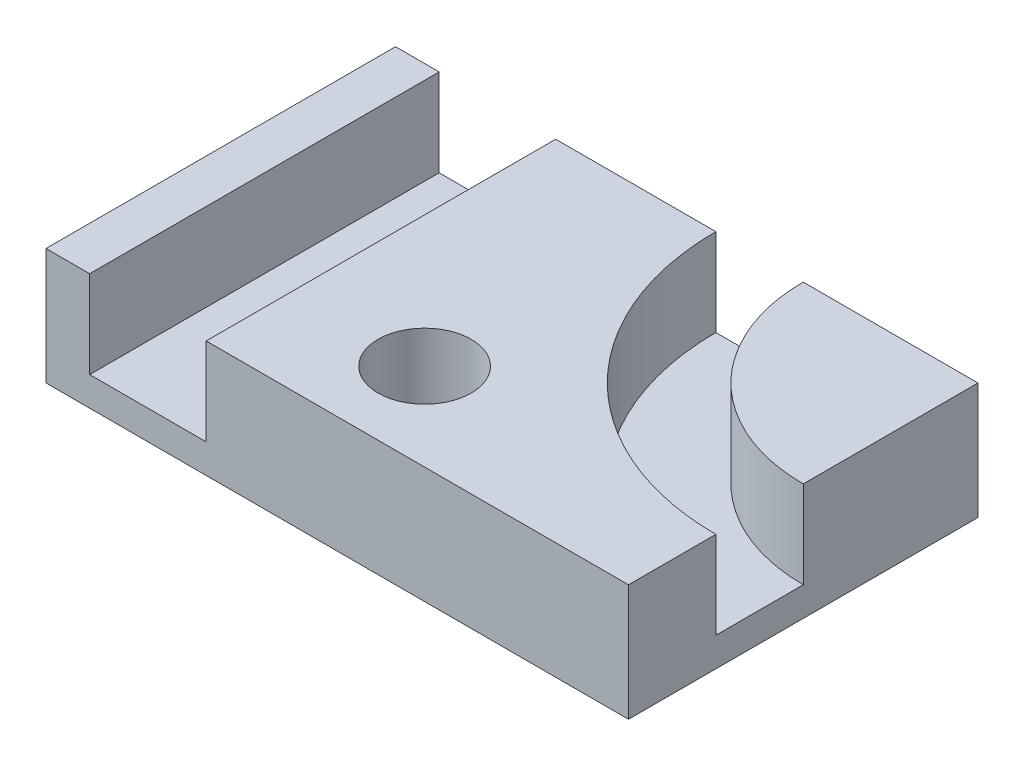
ISO-10303-21;
HEADER;
FILE_DESCRIPTION(('STEP AP214'),'2;1');
FILE_NAME('part.step','',(''),(''),'','','');
FILE_SCHEMA(('AUTOMOTIVE_DESIGN { 1 0 10303 214 1 1 1 1 }'));
ENDSEC;
DATA;
#1=APPLICATION_CONTEXT('core data for automotive mechanical design processes');
#2=APPLICATION_PROTOCOL_DEFINITION('international standard','automotive_design',2000,#1);
#3=PRODUCT_CONTEXT('',#1,'mechanical');
#4=PRODUCT('Part','Part','',(#3));
#5=PRODUCT_RELATED_PRODUCT_CATEGORY('part','',(#4));
#6=PRODUCT_DEFINITION_FORMATION('','',#4);
#7=PRODUCT_DEFINITION_CONTEXT('part definition',#1,'design');
#8=PRODUCT_DEFINITION('design','',#6,#7);
#9=PRODUCT_DEFINITION_SHAPE('','',#8);
#10=(LENGTH_UNIT() NAMED_UNIT(*) SI_UNIT(.MILLI.,.METRE.));
#11=(NAMED_UNIT(*) PLANE_ANGLE_UNIT() SI_UNIT($,.RADIAN.));
#12=(NAMED_UNIT(*) SI_UNIT($,.STERADIAN.) SOLID_ANGLE_UNIT());
#13=UNCERTAINTY_MEASURE_WITH_UNIT(LENGTH_MEASURE(1.E-05),#10,'distance_accuracy_value','');
#14=(GEOMETRIC_REPRESENTATION_CONTEXT(3) GLOBAL_UNCERTAINTY_ASSIGNED_CONTEXT((#13)) GLOBAL_UNIT_ASSIGNED_CONTEXT((#10,
#11,#12)) REPRESENTATION_CONTEXT('',''));
#15=CARTESIAN_POINT('',(0.,0.,0.));
#16=DIRECTION('',(0.,0.,1.));
#17=DIRECTION('',(1.,0.,0.));
#18=AXIS2_PLACEMENT_3D('',#15,#16,#17);
#19=CARTESIAN_POINT('',(0.,20.,0.));
#20=DIRECTION('',(0.,-1.,0.));
#21=DIRECTION('',(0.,0.,-1.));
#22=AXIS2_PLACEMENT_3D('',#19,#20,#21);
#23=PLANE('',#22);
#24=CARTESIAN_POINT('',(0.,20.,15.));
#25=DIRECTION('',(0.,1.,0.));
#26=DIRECTION('',(0.,0.,1.));
#27=AXIS2_PLACEMENT_3D('',#24,#25,#26);
#28=CIRCLE('',#27,8.);
#29=CARTESIAN_POINT('',(0.,20.,23.));
#30=VERTEX_POINT('',#29);
#31=EDGE_CURVE('E389',#30,#30,#28,.T.);
#32=ORIENTED_EDGE('',*,*,#31,.F.);
#33=EDGE_LOOP('',(#32));
#34=FACE_BOUND('',#33,.T.);
#35=DIRECTION('',(-1.,0.,0.));
#36=VECTOR('',#35,1.);
#37=CARTESIAN_POINT('',(50.,20.,-30.));
#38=LINE('',#37,#36);
#39=CARTESIAN_POINT('',(5.00230533997547,20.0000000000066,-29.9999999823923));
#40=VERTEX_POINT('',#39);
#41=CARTESIAN_POINT('',(-22.4988473300123,20.,-29.9999999911961));
#42=VERTEX_POINT('',#41);
#43=EDGE_CURVE('E228',#40,#42,#38,.T.);
#44=ORIENTED_EDGE('',*,*,#43,.T.);
#45=DIRECTION('',(0.,0.,-1.));
#46=VECTOR('',#45,1.);
#47=CARTESIAN_POINT('',(-22.4988473300123,20.,-29.9999999911961));
#48=LINE('',#47,#46);
#49=CARTESIAN_POINT('',(-22.4988473300123,20.,30.));
#50=VERTEX_POINT('',#49);
#51=EDGE_CURVE('E131',#50,#42,#48,.T.);
#52=ORIENTED_EDGE('',*,*,#51,.F.);
#53=DIRECTION('',(1.,0.,0.));
#54=VECTOR('',#53,1.);
#55=CARTESIAN_POINT('',(50.,20.,30.));
#56=LINE('',#55,#54);
#57=CARTESIAN_POINT('',(50.,20.,30.));
#58=VERTEX_POINT('',#57);
#59=EDGE_CURVE('E182',#50,#58,#56,.T.);
#60=ORIENTED_EDGE('',*,*,#59,.T.);
#61=DIRECTION('',(0.,0.,-1.));
#62=VECTOR('',#61,1.);
#63=CARTESIAN_POINT('',(50.,20.,-30.));
#64=LINE('',#63,#62);
#65=CARTESIAN_POINT('',(50.,20.,14.9992414456202));
#66=VERTEX_POINT('',#65);
#67=EDGE_CURVE('E195',#58,#66,#64,.T.);
#68=ORIENTED_EDGE('',*,*,#67,.T.);
#69=CARTESIAN_POINT('',(51.4153309673462,20.,14.9796220876293));
#70=CARTESIAN_POINT('',(50.9547824905195,20.,14.9922686550845));
#71=CARTESIAN_POINT('',(50.4676108378161,20.,14.999999696343));
#72=CARTESIAN_POINT('',(47.0951666430904,20.,15.0000018863399));
#73=CARTESIAN_POINT('',(44.1755163550307,20.0000000000045,14.716144606431));
#74=CARTESIAN_POINT('',(38.3020075855144,19.9999999999958,13.5503572406229));
#75=CARTESIAN_POINT('',(35.3702497173021,20.000000000005,12.6690178798986));
#76=CARTESIAN_POINT('',(26.7731310008656,19.9999999999915,9.04114662188423));
#77=CARTESIAN_POINT('',(21.512219414981,20.0000000000018,5.39916392569056));
#78=CARTESIAN_POINT('',(12.8894658556455,20.0000000000018,-3.78048895887511));
#79=CARTESIAN_POINT('',(9.67389335171333,20.0000000000036,-9.15819830833402));
#80=CARTESIAN_POINT('',(6.64605053677977,20.0000000000036,-17.5770754895131));
#81=CARTESIAN_POINT('',(5.94509295226682,20.0000000000004,-20.3939198419866));
#82=CARTESIAN_POINT('',(5.0855304475035,20.0000000000086,-26.0248420934446));
#83=CARTESIAN_POINT('',(4.94845461313945,20.0000000000054,-28.7961091643683));
#84=CARTESIAN_POINT('',(5.02037791237072,20.0000000000054,-31.415330967346));
#85=B_SPLINE_CURVE_WITH_KNOTS('',3,(#69,#70,#71,#72,#73,#74,#75,#76,#77,#78,#79,#80,#81,#82,#83,
#84),.UNSPECIFIED.,.F.,.F.,(4,2,2,2,2,2,2,4),(0.,0.0197251902584563,0.142259541476149,
0.264793892693842,0.509862595129228,0.754931297564614,0.877465648782307,1.),.UNSPECIFIED.);
#86=EDGE_CURVE('E158',#66,#40,#85,.T.);
#87=ORIENTED_EDGE('',*,*,#86,.T.);
#88=EDGE_LOOP('',(#44,#52,#60,#68,#87));
#89=FACE_BOUND('',#88,.T.);
#90=ADVANCED_FACE('F33',(#34,#89),#23,.F.);
#91=CARTESIAN_POINT('',(50.,20.,-30.));
#92=DIRECTION('',(-1.,0.,0.));
#93=DIRECTION('',(0.,0.,1.));
#94=AXIS2_PLACEMENT_3D('',#91,#92,#93);
#95=PLANE('',#94);
#96=DIRECTION('',(0.,-1.,0.));
#97=VECTOR('',#96,1.);
#98=CARTESIAN_POINT('',(50.,12.5,15.));
#99=LINE('',#98,#97);
#100=CARTESIAN_POINT('',(50.0000004554452,4.99999999999659,14.9988067658875));
#101=VERTEX_POINT('',#100);
#102=EDGE_CURVE('E367',#101,#66,#99,.F.);
#103=ORIENTED_EDGE('',*,*,#102,.T.);
#104=ORIENTED_EDGE('',*,*,#67,.F.);
#105=DIRECTION('',(0.,-1.,0.));
#106=VECTOR('',#105,1.);
#107=CARTESIAN_POINT('',(50.,20.,30.));
#108=LINE('',#107,#106);
#109=CARTESIAN_POINT('',(50.,0.,30.));
#110=VERTEX_POINT('',#109);
#111=EDGE_CURVE('E43',#58,#110,#108,.T.);
#112=ORIENTED_EDGE('',*,*,#111,.T.);
#113=DIRECTION('',(0.,0.,-1.));
#114=VECTOR('',#113,1.);
#115=CARTESIAN_POINT('',(50.,0.,-30.));
#116=LINE('',#115,#114);
#117=CARTESIAN_POINT('',(50.,0.,-30.));
#118=VERTEX_POINT('',#117);
#119=EDGE_CURVE('E208',#110,#118,#116,.T.);
#120=ORIENTED_EDGE('',*,*,#119,.T.);
#121=DIRECTION('',(0.,-1.,0.));
#122=VECTOR('',#121,1.);
#123=CARTESIAN_POINT('',(50.,20.,-30.));
#124=LINE('',#123,#122);
#125=CARTESIAN_POINT('',(50.,20.,-30.));
#126=VERTEX_POINT('',#125);
#127=EDGE_CURVE('E200',#126,#118,#124,.T.);
#128=ORIENTED_EDGE('',*,*,#127,.F.);
#129=CARTESIAN_POINT('',(50.,20.,-0.00129815400017053));
#130=VERTEX_POINT('',#129);
#131=EDGE_CURVE('E187',#130,#126,#64,.T.);
#132=ORIENTED_EDGE('',*,*,#131,.F.);
#133=DIRECTION('',(0.,1.,0.));
#134=VECTOR('',#133,1.);
#135=CARTESIAN_POINT('',(50.,12.5,0.));
#136=LINE('',#135,#134);
#137=CARTESIAN_POINT('',(50.0000044277978,5.,-0.00064989275972179));
#138=VERTEX_POINT('',#137);
#139=EDGE_CURVE('E59',#130,#138,#136,.F.);
#140=ORIENTED_EDGE('',*,*,#139,.T.);
#141=DIRECTION('',(0.,-3.03599773165915E-13,1.));
#142=VECTOR('',#141,1.);
#143=CARTESIAN_POINT('',(50.,5.00000000000001,-0.014725805378779));
#144=LINE('',#143,#142);
#145=EDGE_CURVE('E362',#138,#101,#144,.T.);
#146=ORIENTED_EDGE('',*,*,#145,.T.);
#147=EDGE_LOOP('',(#103,#104,#112,#120,#128,#132,#140,#146));
#148=FACE_BOUND('',#147,.T.);
#149=ADVANCED_FACE('F235',(#148),#95,.F.);
#150=CARTESIAN_POINT('',(50.,20.,-30.));
#151=DIRECTION('',(0.,0.,1.));
#152=DIRECTION('',(1.,0.,0.));
#153=AXIS2_PLACEMENT_3D('',#150,#151,#152);
#154=PLANE('',#153);
#155=DIRECTION('',(-1.,0.,0.));
#156=VECTOR('',#155,1.);
#157=CARTESIAN_POINT('',(-22.4988473300123,5.,-29.9999999911961));
#158=LINE('',#157,#156);
#159=CARTESIAN_POINT('',(-22.4988473300123,5.,-29.9999999911961));
#160=VERTEX_POINT('',#159);
#161=CARTESIAN_POINT('',(-42.4988473300123,5.,-29.9999999911961));
#162=VERTEX_POINT('',#161);
#163=EDGE_CURVE('E140',#160,#162,#158,.T.);
#164=ORIENTED_EDGE('',*,*,#163,.F.);
#165=DIRECTION('',(0.,1.,0.));
#166=VECTOR('',#165,1.);
#167=CARTESIAN_POINT('',(-22.4988473300123,5.,-29.9999999911961));
#168=LINE('',#167,#166);
#169=EDGE_CURVE('E126',#160,#42,#168,.T.);
#170=ORIENTED_EDGE('',*,*,#169,.T.);
#171=ORIENTED_EDGE('',*,*,#43,.F.);
#172=DIRECTION('',(0.,-1.,0.));
#173=VECTOR('',#172,1.);
#174=CARTESIAN_POINT('',(5.00231424819114,12.5000000000055,-30.));
#175=LINE('',#174,#173);
#176=CARTESIAN_POINT('',(5.00229397754522,5.00000000000796,-29.9999999947464));
#177=VERTEX_POINT('',#176);
#178=EDGE_CURVE('E173',#40,#177,#175,.T.);
#179=ORIENTED_EDGE('',*,*,#178,.T.);
#180=DIRECTION('',(1.,0.,0.));
#181=VECTOR('',#180,1.);
#182=CARTESIAN_POINT('',(51.0035892237188,5.0000000000091,-30.));
#183=LINE('',#182,#181);
#184=CARTESIAN_POINT('',(20.0021917962839,4.99999999999836,-29.9999998183633));
#185=VERTEX_POINT('',#184);
#186=EDGE_CURVE('E168',#177,#185,#183,.T.);
#187=ORIENTED_EDGE('',*,*,#186,.T.);
#188=DIRECTION('',(0.,1.,0.));
#189=VECTOR('',#188,1.);
#190=CARTESIAN_POINT('',(20.0020834887706,12.4999999999947,-30.));
#191=LINE('',#190,#189);
#192=CARTESIAN_POINT('',(20.0023017946604,20.000000000002,-30.0000008831575));
#193=VERTEX_POINT('',#192);
#194=EDGE_CURVE('E172',#185,#193,#191,.T.);
#195=ORIENTED_EDGE('',*,*,#194,.T.);
#196=EDGE_CURVE('E206',#126,#193,#38,.T.);
#197=ORIENTED_EDGE('',*,*,#196,.F.);
#198=ORIENTED_EDGE('',*,*,#127,.T.);
#199=DIRECTION('',(-1.,0.,0.));
#200=VECTOR('',#199,1.);
#201=CARTESIAN_POINT('',(50.,0.,-30.));
#202=LINE('',#201,#200);
#203=CARTESIAN_POINT('',(-50.,0.,-30.));
#204=VERTEX_POINT('',#203);
#205=EDGE_CURVE('E183',#118,#204,#202,.T.);
#206=ORIENTED_EDGE('',*,*,#205,.T.);
#207=DIRECTION('',(0.,-1.,0.));
#208=VECTOR('',#207,1.);
#209=CARTESIAN_POINT('',(-50.,20.,-30.));
#210=LINE('',#209,#208);
#211=CARTESIAN_POINT('',(-50.,20.,-30.));
#212=VERTEX_POINT('',#211);
#213=EDGE_CURVE('E203',#212,#204,#210,.T.);
#214=ORIENTED_EDGE('',*,*,#213,.F.);
#215=CARTESIAN_POINT('',(-42.4988473300123,20.,-29.9999999911961));
#216=VERTEX_POINT('',#215);
#217=EDGE_CURVE('E37',#216,#212,#38,.T.);
#218=ORIENTED_EDGE('',*,*,#217,.F.);
#219=DIRECTION('',(0.,1.,0.));
#220=VECTOR('',#219,1.);
#221=CARTESIAN_POINT('',(-42.4988473300123,5.,-29.9999999911961));
#222=LINE('',#221,#220);
#223=EDGE_CURVE('E136',#162,#216,#222,.T.);
#224=ORIENTED_EDGE('',*,*,#223,.F.);
#225=EDGE_LOOP('',(#164,#170,#171,#179,#187,#195,#197,#198,#206,#214,#218,#224));
#226=FACE_BOUND('',#225,.T.);
#227=ADVANCED_FACE('F146',(#226),#154,.F.);
#228=CARTESIAN_POINT('',(-50.,20.,30.));
#229=VERTEX_POINT('',#228);
#230=CARTESIAN_POINT('',(-42.4988473300123,20.,30.));
#231=VERTEX_POINT('',#230);
#232=EDGE_CURVE('E184',#229,#231,#56,.T.);
#233=ORIENTED_EDGE('',*,*,#232,.T.);
#234=DIRECTION('',(0.,0.,1.));
#235=VECTOR('',#234,1.);
#236=CARTESIAN_POINT('',(-42.4988473300123,20.,-29.9999999911961));
#237=LINE('',#236,#235);
#238=EDGE_CURVE('E144',#216,#231,#237,.T.);
#239=ORIENTED_EDGE('',*,*,#238,.F.);
#240=ORIENTED_EDGE('',*,*,#217,.T.);
#241=DIRECTION('',(0.,0.,1.));
#242=VECTOR('',#241,1.);
#243=CARTESIAN_POINT('',(-50.,20.,-30.));
#244=LINE('',#243,#242);
#245=EDGE_CURVE('E179',#212,#229,#244,.T.);
#246=ORIENTED_EDGE('',*,*,#245,.T.);
#247=EDGE_LOOP('',(#233,#239,#240,#246));
#248=FACE_BOUND('',#247,.T.);
#249=ADVANCED_FACE('F227',(#248),#23,.F.);
#250=CARTESIAN_POINT('',(51.0035892237188,20.,-0.0147258053787734));
#251=CARTESIAN_POINT('',(50.6675461597241,20.,-0.00549813077112738));
#252=CARTESIAN_POINT('',(50.3021401439255,20.,-1.21449486066342E-07));
#253=CARTESIAN_POINT('',(48.1230829194733,20.,7.54453204189384E-07));
#254=CARTESIAN_POINT('',(46.1288433104807,20.0000000000042,-0.18876469205489));
#255=CARTESIAN_POINT('',(42.1892155030268,19.9999999999956,-0.97071097052898));
#256=CARTESIAN_POINT('',(40.2219580309098,20.0000000000041,-1.56448512345736));
#257=CARTESIAN_POINT('',(34.5651708951602,19.9999999999906,-3.95157483196438));
#258=CARTESIAN_POINT('',(30.9693971217354,19.9999999999983,-6.44180903960879));
#259=CARTESIAN_POINT('',(25.2983930586823,19.9999999999983,-12.4790743158476));
#260=CARTESIAN_POINT('',(23.1045763936442,19.9999999999965,-16.1370300503856));
#261=CARTESIAN_POINT('',(21.1030432782689,19.9999999999965,-21.7022680705939));
#262=CARTESIAN_POINT('',(20.6269833219878,19.9999999999955,-23.6161158974178));
#263=CARTESIAN_POINT('',(20.0600989445258,19.9999999999955,-27.3297253928696));
#264=CARTESIAN_POINT('',(19.9645721767431,19.9999999999946,-29.1771507880907));
#265=CARTESIAN_POINT('',(20.0147258053788,19.9999999999946,-31.0035892237186));
#266=B_SPLINE_CURVE_WITH_KNOTS('',3,(#250,#251,#252,#253,#254,#255,#256,#257,#258,#259,#260,
#261,#262,#263,#264,#265),.UNSPECIFIED.,.F.,.F.,(4,2,2,2,2,2,2,4),(0.,0.0197251902584563,
0.142259541476149,0.264793892693842,0.509862595129228,0.754931297564614,0.877465648782307,1.),.UNSPECIFIED.);
#267=EDGE_CURVE('E245',#130,#193,#266,.T.);
#268=ORIENTED_EDGE('',*,*,#267,.F.);
#269=ORIENTED_EDGE('',*,*,#131,.T.);
#270=ORIENTED_EDGE('',*,*,#196,.T.);
#271=EDGE_LOOP('',(#268,#269,#270));
#272=FACE_BOUND('',#271,.T.);
#273=ADVANCED_FACE('F259',(#272),#23,.F.);
#274=CARTESIAN_POINT('',(-50.,20.,-30.));
#275=DIRECTION('',(1.,0.,0.));
#276=DIRECTION('',(0.,0.,-1.));
#277=AXIS2_PLACEMENT_3D('',#274,#275,#276);
#278=PLANE('',#277);
#279=DIRECTION('',(0.,0.,1.));
#280=VECTOR('',#279,1.);
#281=CARTESIAN_POINT('',(-50.,0.,-30.));
#282=LINE('',#281,#280);
#283=CARTESIAN_POINT('',(-50.,0.,30.));
#284=VERTEX_POINT('',#283);
#285=EDGE_CURVE('E178',#204,#284,#282,.T.);
#286=ORIENTED_EDGE('',*,*,#285,.T.);
#287=DIRECTION('',(0.,-1.,0.));
#288=VECTOR('',#287,1.);
#289=CARTESIAN_POINT('',(-50.,20.,30.));
#290=LINE('',#289,#288);
#291=EDGE_CURVE('E11',#229,#284,#290,.T.);
#292=ORIENTED_EDGE('',*,*,#291,.F.);
#293=ORIENTED_EDGE('',*,*,#245,.F.);
#294=ORIENTED_EDGE('',*,*,#213,.T.);
#295=EDGE_LOOP('',(#286,#292,#293,#294));
#296=FACE_BOUND('',#295,.T.);
#297=ADVANCED_FACE('F35',(#296),#278,.F.);
#298=CARTESIAN_POINT('',(50.,20.,30.));
#299=DIRECTION('',(0.,0.,-1.));
#300=DIRECTION('',(-1.,0.,0.));
#301=AXIS2_PLACEMENT_3D('',#298,#299,#300);
#302=PLANE('',#301);
#303=ORIENTED_EDGE('',*,*,#59,.F.);
#304=DIRECTION('',(0.,1.,0.));
#305=VECTOR('',#304,1.);
#306=CARTESIAN_POINT('',(-22.4988473300123,5.,30.));
#307=LINE('',#306,#305);
#308=CARTESIAN_POINT('',(-22.4988473300123,5.,30.));
#309=VERTEX_POINT('',#308);
#310=EDGE_CURVE('E156',#309,#50,#307,.T.);
#311=ORIENTED_EDGE('',*,*,#310,.F.);
#312=DIRECTION('',(1.,0.,0.));
#313=VECTOR('',#312,1.);
#314=CARTESIAN_POINT('',(-22.4988473300123,5.,30.));
#315=LINE('',#314,#313);
#316=CARTESIAN_POINT('',(-42.4988473300123,5.,30.));
#317=VERTEX_POINT('',#316);
#318=EDGE_CURVE('E137',#317,#309,#315,.T.);
#319=ORIENTED_EDGE('',*,*,#318,.F.);
#320=DIRECTION('',(0.,1.,0.));
#321=VECTOR('',#320,1.);
#322=CARTESIAN_POINT('',(-42.4988473300123,5.,30.));
#323=LINE('',#322,#321);
#324=EDGE_CURVE('E159',#317,#231,#323,.T.);
#325=ORIENTED_EDGE('',*,*,#324,.T.);
#326=ORIENTED_EDGE('',*,*,#232,.F.);
#327=ORIENTED_EDGE('',*,*,#291,.T.);
#328=DIRECTION('',(1.,0.,0.));
#329=VECTOR('',#328,1.);
#330=CARTESIAN_POINT('',(50.,0.,30.));
#331=LINE('',#330,#329);
#332=EDGE_CURVE('E210',#284,#110,#331,.T.);
#333=ORIENTED_EDGE('',*,*,#332,.T.);
#334=ORIENTED_EDGE('',*,*,#111,.F.);
#335=EDGE_LOOP('',(#303,#311,#319,#325,#326,#327,#333,#334));
#336=FACE_BOUND('',#335,.T.);
#337=ADVANCED_FACE('F224',(#336),#302,.F.);
#338=CARTESIAN_POINT('',(0.,0.,0.));
#339=DIRECTION('',(0.,-1.,0.));
#340=DIRECTION('',(0.,0.,-1.));
#341=AXIS2_PLACEMENT_3D('',#338,#339,#340);
#342=PLANE('',#341);
#343=ORIENTED_EDGE('',*,*,#285,.F.);
#344=ORIENTED_EDGE('',*,*,#205,.F.);
#345=ORIENTED_EDGE('',*,*,#119,.F.);
#346=ORIENTED_EDGE('',*,*,#332,.F.);
#347=EDGE_LOOP('',(#343,#344,#345,#346));
#348=FACE_BOUND('',#347,.T.);
#349=ADVANCED_FACE('F219',(#348),#342,.T.);
#350=CARTESIAN_POINT('',(51.4153309673462,20.,14.9796220876293));
#351=CARTESIAN_POINT('',(50.9547824905195,20.,14.9922686550845));
#352=CARTESIAN_POINT('',(50.4676108378161,20.,14.999999696343));
#353=CARTESIAN_POINT('',(47.0951666430904,20.,15.0000018863399));
#354=CARTESIAN_POINT('',(44.1755163550307,20.0000000000045,14.716144606431));
#355=CARTESIAN_POINT('',(38.3020075855144,19.9999999999958,13.5503572406229));
#356=CARTESIAN_POINT('',(35.3702497173021,20.000000000005,12.6690178798986));
#357=CARTESIAN_POINT('',(26.7731310008656,19.9999999999915,9.04114662188423));
#358=CARTESIAN_POINT('',(21.512219414981,20.0000000000018,5.39916392569056));
#359=CARTESIAN_POINT('',(12.8894658556455,20.0000000000018,-3.78048895887511));
#360=CARTESIAN_POINT('',(9.67389335171333,20.0000000000036,-9.15819830833402));
#361=CARTESIAN_POINT('',(6.64605053677977,20.0000000000036,-17.5770754895131));
#362=CARTESIAN_POINT('',(5.94509295226682,20.0000000000004,-20.3939198419866));
#363=CARTESIAN_POINT('',(5.0855304475035,20.0000000000086,-26.0248420934446));
#364=CARTESIAN_POINT('',(4.94845461313945,20.0000000000054,-28.7961091643683));
#365=CARTESIAN_POINT('',(5.02037791237072,20.0000000000054,-31.415330967346));
#366=CARTESIAN_POINT('',(51.4153309673462,5.,14.9796220876293));
#367=CARTESIAN_POINT('',(50.9547824905195,5.,14.9922686550849));
#368=CARTESIAN_POINT('',(50.4676108378161,5.00000000000001,14.999999696343));
#369=CARTESIAN_POINT('',(47.0951666430904,5.00000000000001,15.0000018863399));
#370=CARTESIAN_POINT('',(44.1755163550306,5.0000000000034,14.7161446064313));
#371=CARTESIAN_POINT('',(38.3020075855142,4.99999999999689,13.5503572406231));
#372=CARTESIAN_POINT('',(35.3702497173017,5.00000000000497,12.6690178798994));
#373=CARTESIAN_POINT('',(26.7731310008652,4.99999999999155,9.04114662188505));
#374=CARTESIAN_POINT('',(21.5122194149785,5.00000000000177,5.3991639256748));
#375=CARTESIAN_POINT('',(12.889465855643,5.00000000000177,-3.78048895885466));
#376=CARTESIAN_POINT('',(9.67389335170673,5.00000000000141,-9.15819830833163));
#377=CARTESIAN_POINT('',(6.64605053677317,5.00000000000463,-17.5770754895107));
#378=CARTESIAN_POINT('',(5.945092952259,5.00000000000348,-20.3939198419852));
#379=CARTESIAN_POINT('',(5.08553044749363,5.00000000000553,-26.0248420934432));
#380=CARTESIAN_POINT('',(4.94845461312867,5.0000000000054,-28.7961091643684));
#381=CARTESIAN_POINT('',(5.02037791235995,5.0000000000054,-31.4153309673463));
#382=B_SPLINE_SURFACE_WITH_KNOTS('',1,3,((#350,#351,#352,#353,#354,#355,#356,#357,#358,#359,
#360,#361,#362,#363,#364,#365),(#366,#367,#368,#369,#370,#371,#372,#373,#374,#375,#376,#377,
#378,#379,#380,#381)),.UNSPECIFIED.,.F.,.F.,.F.,(2,2),(4,2,2,2,2,2,2,4),(0.,1.),(0.,
0.0197251902584563,0.142259541476149,0.264793892693842,0.509862595129228,0.754931297564614,
0.877465648782307,1.),.UNSPECIFIED.);
#383=CARTESIAN_POINT('',(51.4153309673462,5.,14.9796220876293));
#384=CARTESIAN_POINT('',(50.9547824905195,5.,14.9922686550849));
#385=CARTESIAN_POINT('',(50.4676108378161,5.00000000000001,14.999999696343));
#386=CARTESIAN_POINT('',(47.0951666430904,5.00000000000001,15.0000018863399));
#387=CARTESIAN_POINT('',(44.1755163550306,5.0000000000034,14.7161446064313));
#388=CARTESIAN_POINT('',(38.3020075855142,4.99999999999689,13.5503572406231));
#389=CARTESIAN_POINT('',(35.3702497173017,5.00000000000497,12.6690178798994));
#390=CARTESIAN_POINT('',(26.7731310008652,4.99999999999155,9.04114662188505));
#391=CARTESIAN_POINT('',(21.5122194149785,5.00000000000177,5.3991639256748));
#392=CARTESIAN_POINT('',(12.889465855643,5.00000000000177,-3.78048895885466));
#393=CARTESIAN_POINT('',(9.67389335170673,5.00000000000141,-9.15819830833163));
#394=CARTESIAN_POINT('',(6.64605053677317,5.00000000000463,-17.5770754895107));
#395=CARTESIAN_POINT('',(5.945092952259,5.00000000000348,-20.3939198419852));
#396=CARTESIAN_POINT('',(5.08553044749363,5.00000000000553,-26.0248420934432));
#397=CARTESIAN_POINT('',(4.94845461312867,5.0000000000054,-28.7961091643684));
#398=CARTESIAN_POINT('',(5.02037791235995,5.0000000000054,-31.4153309673463));
#399=B_SPLINE_CURVE_WITH_KNOTS('',3,(#383,#384,#385,#386,#387,#388,#389,#390,#391,#392,#393,
#394,#395,#396,#397,#398),.UNSPECIFIED.,.F.,.F.,(4,2,2,2,2,2,2,4),(0.,0.0197251902584563,
0.142259541476149,0.264793892693842,0.509862595129228,0.754931297564614,0.877465648782307,1.),.UNSPECIFIED.);
#400=EDGE_CURVE('E302',#101,#177,#399,.T.);
#401=ORIENTED_EDGE('',*,*,#86,.F.);
#402=ORIENTED_EDGE('',*,*,#102,.F.);
#403=ORIENTED_EDGE('',*,*,#400,.T.);
#404=ORIENTED_EDGE('',*,*,#178,.F.);
#405=EDGE_LOOP('',(#401,#402,#403,#404));
#406=FACE_BOUND('',#405,.T.);
#407=ADVANCED_FACE('F327',(#406),#382,.T.);
#408=CARTESIAN_POINT('',(51.0035892237188,5.,-0.014725805378779));
#409=DIRECTION('',(0.,1.,3.03599773165915E-13));
#410=DIRECTION('',(0.,-3.03599773165915E-13,1.));
#411=AXIS2_PLACEMENT_3D('',#408,#409,#410);
#412=PLANE('',#411);
#413=ORIENTED_EDGE('',*,*,#400,.F.);
#414=ORIENTED_EDGE('',*,*,#145,.F.);
#415=CARTESIAN_POINT('',(51.0035892237188,5.,-0.014725805378779));
#416=CARTESIAN_POINT('',(50.6675461597241,5.,-0.00549813077113301));
#417=CARTESIAN_POINT('',(50.3021401439255,5.,-1.21449490938685E-07));
#418=CARTESIAN_POINT('',(48.1230829194733,5.,7.54453221945786E-07));
#419=CARTESIAN_POINT('',(46.1288433104806,5.00000000000423,-0.188764692054659));
#420=CARTESIAN_POINT('',(42.1892155030267,4.99999999999555,-0.970710970528749));
#421=CARTESIAN_POINT('',(40.2219580309094,5.00000000000405,-1.56448512345653));
#422=CARTESIAN_POINT('',(34.5651708951598,4.99999999999063,-3.95157483196355));
#423=CARTESIAN_POINT('',(30.9693971217329,4.99999999999834,-6.44180903960645));
#424=CARTESIAN_POINT('',(25.2983930586798,4.99999999999834,-12.4790743158452));
#425=CARTESIAN_POINT('',(23.1045763936376,4.99999999999653,-16.1370300503832));
#426=CARTESIAN_POINT('',(21.1030432782623,4.99999999999653,-21.7022680705915));
#427=CARTESIAN_POINT('',(20.6269833219748,4.99999999999554,-23.6161158974164));
#428=CARTESIAN_POINT('',(20.060098944521,4.99999999999554,-27.3297253928682));
#429=CARTESIAN_POINT('',(19.9645721767362,4.99999999999461,-29.1771507880905));
#430=CARTESIAN_POINT('',(20.014725805368,4.99999999999461,-31.0035892237189));
#431=B_SPLINE_CURVE_WITH_KNOTS('',3,(#415,#416,#417,#418,#419,#420,#421,#422,#423,#424,#425,
#426,#427,#428,#429,#430),.UNSPECIFIED.,.F.,.F.,(4,2,2,2,2,2,2,4),(0.,0.0197251902584563,
0.142259541476149,0.264793892693842,0.509862595129228,0.754931297564614,0.877465648782307,1.),.UNSPECIFIED.);
#432=EDGE_CURVE('E277',#138,#185,#431,.T.);
#433=ORIENTED_EDGE('',*,*,#432,.T.);
#434=ORIENTED_EDGE('',*,*,#186,.F.);
#435=EDGE_LOOP('',(#413,#414,#433,#434));
#436=FACE_BOUND('',#435,.T.);
#437=ADVANCED_FACE('F318',(#436),#412,.T.);
#438=CARTESIAN_POINT('',(51.0035892237188,5.,-0.014725805378779));
#439=CARTESIAN_POINT('',(50.6675461597241,5.,-0.00549813077113301));
#440=CARTESIAN_POINT('',(50.3021401439255,5.,-1.21449490938685E-07));
#441=CARTESIAN_POINT('',(48.1230829194733,5.,7.54453221945786E-07));
#442=CARTESIAN_POINT('',(46.1288433104806,5.00000000000423,-0.188764692054659));
#443=CARTESIAN_POINT('',(42.1892155030267,4.99999999999555,-0.970710970528749));
#444=CARTESIAN_POINT('',(40.2219580309094,5.00000000000405,-1.56448512345653));
#445=CARTESIAN_POINT('',(34.5651708951598,4.99999999999063,-3.95157483196355));
#446=CARTESIAN_POINT('',(30.9693971217329,4.99999999999834,-6.44180903960645));
#447=CARTESIAN_POINT('',(25.2983930586798,4.99999999999834,-12.4790743158452));
#448=CARTESIAN_POINT('',(23.1045763936376,4.99999999999653,-16.1370300503832));
#449=CARTESIAN_POINT('',(21.1030432782623,4.99999999999653,-21.7022680705915));
#450=CARTESIAN_POINT('',(20.6269833219748,4.99999999999554,-23.6161158974164));
#451=CARTESIAN_POINT('',(20.060098944521,4.99999999999554,-27.3297253928682));
#452=CARTESIAN_POINT('',(19.9645721767362,4.99999999999461,-29.1771507880905));
#453=CARTESIAN_POINT('',(20.014725805368,4.99999999999461,-31.0035892237189));
#454=CARTESIAN_POINT('',(51.0035892237188,20.,-0.0147258053787734));
#455=CARTESIAN_POINT('',(50.6675461597241,20.,-0.00549813077112738));
#456=CARTESIAN_POINT('',(50.3021401439255,20.,-1.21449486066342E-07));
#457=CARTESIAN_POINT('',(48.1230829194733,20.,7.54453204189384E-07));
#458=CARTESIAN_POINT('',(46.1288433104807,20.0000000000042,-0.18876469205489));
#459=CARTESIAN_POINT('',(42.1892155030268,19.9999999999956,-0.97071097052898));
#460=CARTESIAN_POINT('',(40.2219580309098,20.0000000000041,-1.56448512345736));
#461=CARTESIAN_POINT('',(34.5651708951602,19.9999999999906,-3.95157483196438));
#462=CARTESIAN_POINT('',(30.9693971217354,19.9999999999983,-6.44180903960879));
#463=CARTESIAN_POINT('',(25.2983930586823,19.9999999999983,-12.4790743158476));
#464=CARTESIAN_POINT('',(23.1045763936442,19.9999999999965,-16.1370300503856));
#465=CARTESIAN_POINT('',(21.1030432782689,19.9999999999965,-21.7022680705939));
#466=CARTESIAN_POINT('',(20.6269833219878,19.9999999999955,-23.6161158974178));
#467=CARTESIAN_POINT('',(20.0600989445258,19.9999999999955,-27.3297253928696));
#468=CARTESIAN_POINT('',(19.9645721767431,19.9999999999946,-29.1771507880907));
#469=CARTESIAN_POINT('',(20.0147258053788,19.9999999999946,-31.0035892237186));
#470=B_SPLINE_SURFACE_WITH_KNOTS('',1,3,((#438,#439,#440,#441,#442,#443,#444,#445,#446,#447,
#448,#449,#450,#451,#452,#453),(#454,#455,#456,#457,#458,#459,#460,#461,#462,#463,#464,#465,
#466,#467,#468,#469)),.UNSPECIFIED.,.F.,.F.,.F.,(2,2),(4,2,2,2,2,2,2,4),(0.,1.),(0.,
0.0197251902584563,0.142259541476149,0.264793892693842,0.509862595129228,0.754931297564614,
0.877465648782307,1.),.UNSPECIFIED.);
#471=ORIENTED_EDGE('',*,*,#432,.F.);
#472=ORIENTED_EDGE('',*,*,#139,.F.);
#473=ORIENTED_EDGE('',*,*,#267,.T.);
#474=ORIENTED_EDGE('',*,*,#194,.F.);
#475=EDGE_LOOP('',(#471,#472,#473,#474));
#476=FACE_BOUND('',#475,.T.);
#477=ADVANCED_FACE('F260',(#476),#470,.T.);
#478=CARTESIAN_POINT('',(-22.4988473300123,5.,-29.9999999911961));
#479=DIRECTION('',(1.,0.,0.));
#480=DIRECTION('',(0.,0.,-1.));
#481=AXIS2_PLACEMENT_3D('',#478,#479,#480);
#482=PLANE('',#481);
#483=ORIENTED_EDGE('',*,*,#51,.T.);
#484=ORIENTED_EDGE('',*,*,#169,.F.);
#485=DIRECTION('',(0.,0.,-1.));
#486=VECTOR('',#485,1.);
#487=CARTESIAN_POINT('',(-22.4988473300123,5.,-29.9999999911961));
#488=LINE('',#487,#486);
#489=EDGE_CURVE('E129',#309,#160,#488,.T.);
#490=ORIENTED_EDGE('',*,*,#489,.F.);
#491=ORIENTED_EDGE('',*,*,#310,.T.);
#492=EDGE_LOOP('',(#483,#484,#490,#491));
#493=FACE_BOUND('',#492,.T.);
#494=ADVANCED_FACE('F128',(#493),#482,.F.);
#495=CARTESIAN_POINT('',(-42.4988473300123,5.,-29.9999999911961));
#496=DIRECTION('',(-1.,0.,0.));
#497=DIRECTION('',(0.,0.,1.));
#498=AXIS2_PLACEMENT_3D('',#495,#496,#497);
#499=PLANE('',#498);
#500=ORIENTED_EDGE('',*,*,#238,.T.);
#501=ORIENTED_EDGE('',*,*,#324,.F.);
#502=DIRECTION('',(0.,0.,1.));
#503=VECTOR('',#502,1.);
#504=CARTESIAN_POINT('',(-42.4988473300123,5.,-29.9999999911961));
#505=LINE('',#504,#503);
#506=EDGE_CURVE('E51',#162,#317,#505,.T.);
#507=ORIENTED_EDGE('',*,*,#506,.F.);
#508=ORIENTED_EDGE('',*,*,#223,.T.);
#509=EDGE_LOOP('',(#500,#501,#507,#508));
#510=FACE_BOUND('',#509,.T.);
#511=ADVANCED_FACE('F405',(#510),#499,.F.);
#512=CARTESIAN_POINT('',(0.,5.,0.));
#513=DIRECTION('',(0.,-1.,0.));
#514=DIRECTION('',(0.,0.,-1.));
#515=AXIS2_PLACEMENT_3D('',#512,#513,#514);
#516=PLANE('',#515);
#517=ORIENTED_EDGE('',*,*,#489,.T.);
#518=ORIENTED_EDGE('',*,*,#163,.T.);
#519=ORIENTED_EDGE('',*,*,#506,.T.);
#520=ORIENTED_EDGE('',*,*,#318,.T.);
#521=EDGE_LOOP('',(#517,#518,#519,#520));
#522=FACE_BOUND('',#521,.T.);
#523=ADVANCED_FACE('F139',(#522),#516,.F.);
#524=CARTESIAN_POINT('',(0.,5.,15.));
#525=DIRECTION('',(0.,1.,0.));
#526=DIRECTION('',(0.,0.,1.));
#527=AXIS2_PLACEMENT_3D('',#524,#525,#526);
#528=CYLINDRICAL_SURFACE('',#527,8.);
#529=CARTESIAN_POINT('',(0.,5.,15.));
#530=DIRECTION('',(0.,1.,0.));
#531=DIRECTION('',(0.,0.,1.));
#532=AXIS2_PLACEMENT_3D('',#529,#530,#531);
#533=CIRCLE('',#532,8.);
#534=CARTESIAN_POINT('',(0.,5.,23.));
#535=VERTEX_POINT('',#534);
#536=EDGE_CURVE('E154',#535,#535,#533,.T.);
#537=ORIENTED_EDGE('',*,*,#536,.F.);
#538=EDGE_LOOP('',(#537));
#539=FACE_BOUND('',#538,.T.);
#540=ORIENTED_EDGE('',*,*,#31,.T.);
#541=EDGE_LOOP('',(#540));
#542=FACE_BOUND('',#541,.T.);
#543=ADVANCED_FACE('F397',(#539,#542),#528,.F.);
#544=CARTESIAN_POINT('',(0.,5.,15.));
#545=DIRECTION('',(0.,1.,0.));
#546=DIRECTION('',(0.,0.,1.));
#547=AXIS2_PLACEMENT_3D('',#544,#545,#546);
#548=PLANE('',#547);
#549=ORIENTED_EDGE('',*,*,#536,.T.);
#550=EDGE_LOOP('',(#549));
#551=FACE_BOUND('',#550,.T.);
#552=ADVANCED_FACE('F395',(#551),#548,.T.);
#553=CLOSED_SHELL('',(#90,#149,#227,#249,#273,#297,#337,#349,#407,#437,#477,#494,#511,#523,#543,#552));
#554=MANIFOLD_SOLID_BREP('B2',#553);
#555=ADVANCED_BREP_SHAPE_REPRESENTATION('',(#18,#554),#14);
#556=SHAPE_DEFINITION_REPRESENTATION(#9,#555);
ENDSEC;
END-ISO-10303-21;
